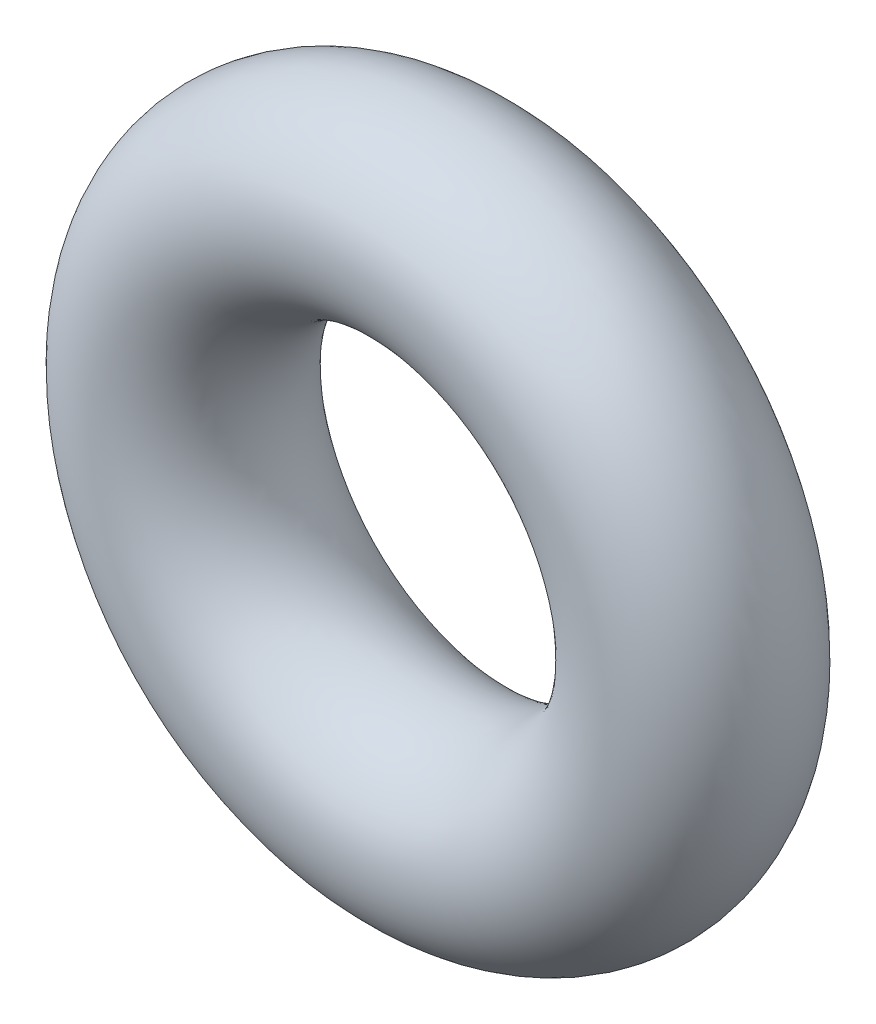
ISO-10303-21;
HEADER;
FILE_DESCRIPTION(('STEP AP214'),'2;1');
FILE_NAME('part.step','',(''),(''),'','','');
FILE_SCHEMA(('AUTOMOTIVE_DESIGN { 1 0 10303 214 1 1 1 1 }'));
ENDSEC;
DATA;
#1=APPLICATION_CONTEXT('core data for automotive mechanical design processes');
#2=APPLICATION_PROTOCOL_DEFINITION('international standard','automotive_design',2000,#1);
#3=PRODUCT_CONTEXT('',#1,'mechanical');
#4=PRODUCT('Part','Part','',(#3));
#5=PRODUCT_RELATED_PRODUCT_CATEGORY('part','',(#4));
#6=PRODUCT_DEFINITION_FORMATION('','',#4);
#7=PRODUCT_DEFINITION_CONTEXT('part definition',#1,'design');
#8=PRODUCT_DEFINITION('design','',#6,#7);
#9=PRODUCT_DEFINITION_SHAPE('','',#8);
#10=(LENGTH_UNIT() NAMED_UNIT(*) SI_UNIT(.MILLI.,.METRE.));
#11=(NAMED_UNIT(*) PLANE_ANGLE_UNIT() SI_UNIT($,.RADIAN.));
#12=(NAMED_UNIT(*) SI_UNIT($,.STERADIAN.) SOLID_ANGLE_UNIT());
#13=UNCERTAINTY_MEASURE_WITH_UNIT(LENGTH_MEASURE(1.E-05),#10,'distance_accuracy_value','');
#14=(GEOMETRIC_REPRESENTATION_CONTEXT(3) GLOBAL_UNCERTAINTY_ASSIGNED_CONTEXT((#13)) GLOBAL_UNIT_ASSIGNED_CONTEXT((#10,
#11,#12)) REPRESENTATION_CONTEXT('',''));
#15=CARTESIAN_POINT('',(0.,0.,0.));
#16=DIRECTION('',(0.,0.,1.));
#17=DIRECTION('',(1.,0.,0.));
#18=AXIS2_PLACEMENT_3D('',#15,#16,#17);
#19=CARTESIAN_POINT('',(0.,0.,0.));
#20=DIRECTION('',(0.,0.,1.));
#21=DIRECTION('',(1.,0.,0.));
#22=AXIS2_PLACEMENT_3D('',#19,#20,#21);
#23=TOROIDAL_SURFACE('',#22,2.3368,0.888999999999999);
#24=CARTESIAN_POINT('',(3.2258,0.,0.));
#25=VERTEX_POINT('',#24);
#26=VERTEX_LOOP('',#25);
#27=FACE_BOUND('',#26,.T.);
#28=ADVANCED_FACE('F28',(#27),#23,.T.);
#29=CLOSED_SHELL('',(#28));
#30=MANIFOLD_SOLID_BREP('B2',#29);
#31=ADVANCED_BREP_SHAPE_REPRESENTATION('',(#18,#30),#14);
#32=SHAPE_DEFINITION_REPRESENTATION(#9,#31);
ENDSEC;
END-ISO-10303-21;
